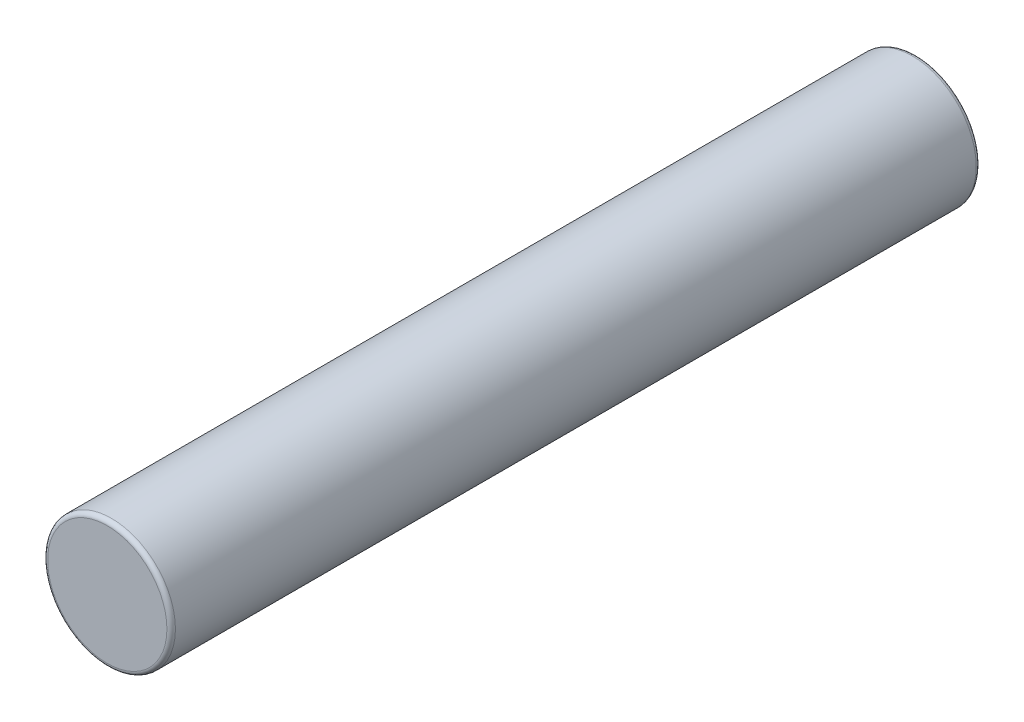
ISO-10303-21;
HEADER;
FILE_DESCRIPTION(('STEP AP214'),'2;1');
FILE_NAME('part.step','',(''),(''),'','','');
FILE_SCHEMA(('AUTOMOTIVE_DESIGN { 1 0 10303 214 1 1 1 1 }'));
ENDSEC;
DATA;
#1=APPLICATION_CONTEXT('core data for automotive mechanical design processes');
#2=APPLICATION_PROTOCOL_DEFINITION('international standard','automotive_design',2000,#1);
#3=PRODUCT_CONTEXT('',#1,'mechanical');
#4=PRODUCT('Part','Part','',(#3));
#5=PRODUCT_RELATED_PRODUCT_CATEGORY('part','',(#4));
#6=PRODUCT_DEFINITION_FORMATION('','',#4);
#7=PRODUCT_DEFINITION_CONTEXT('part definition',#1,'design');
#8=PRODUCT_DEFINITION('design','',#6,#7);
#9=PRODUCT_DEFINITION_SHAPE('','',#8);
#10=(LENGTH_UNIT() NAMED_UNIT(*) SI_UNIT(.MILLI.,.METRE.));
#11=(NAMED_UNIT(*) PLANE_ANGLE_UNIT() SI_UNIT($,.RADIAN.));
#12=(NAMED_UNIT(*) SI_UNIT($,.STERADIAN.) SOLID_ANGLE_UNIT());
#13=UNCERTAINTY_MEASURE_WITH_UNIT(LENGTH_MEASURE(1.E-05),#10,'distance_accuracy_value','');
#14=(GEOMETRIC_REPRESENTATION_CONTEXT(3) GLOBAL_UNCERTAINTY_ASSIGNED_CONTEXT((#13)) GLOBAL_UNIT_ASSIGNED_CONTEXT((#10,
#11,#12)) REPRESENTATION_CONTEXT('',''));
#15=CARTESIAN_POINT('',(0.,0.,0.));
#16=DIRECTION('',(0.,0.,1.));
#17=DIRECTION('',(1.,0.,0.));
#18=AXIS2_PLACEMENT_3D('',#15,#16,#17);
#19=CARTESIAN_POINT('',(0.,0.,-4.75));
#20=DIRECTION('',(0.,0.,1.));
#21=DIRECTION('',(1.,0.,0.));
#22=AXIS2_PLACEMENT_3D('',#19,#20,#21);
#23=CYLINDRICAL_SURFACE('',#22,0.75);
#24=CARTESIAN_POINT('',(0.,0.,-4.7));
#25=DIRECTION('',(0.,0.,1.));
#26=DIRECTION('',(1.,0.,0.));
#27=AXIS2_PLACEMENT_3D('',#24,#25,#26);
#28=CIRCLE('',#27,0.75);
#29=CARTESIAN_POINT('',(0.75,0.,-4.7));
#30=VERTEX_POINT('',#29);
#31=EDGE_CURVE('E41',#30,#30,#28,.T.);
#32=ORIENTED_EDGE('',*,*,#31,.T.);
#33=EDGE_LOOP('',(#32));
#34=FACE_BOUND('',#33,.T.);
#35=CARTESIAN_POINT('',(0.,0.,4.7));
#36=DIRECTION('',(0.,0.,1.));
#37=DIRECTION('',(1.,0.,0.));
#38=AXIS2_PLACEMENT_3D('',#35,#36,#37);
#39=CIRCLE('',#38,0.75);
#40=CARTESIAN_POINT('',(0.75,0.,4.7));
#41=VERTEX_POINT('',#40);
#42=EDGE_CURVE('E45',#41,#41,#39,.F.);
#43=ORIENTED_EDGE('',*,*,#42,.T.);
#44=EDGE_LOOP('',(#43));
#45=FACE_BOUND('',#44,.T.);
#46=ADVANCED_FACE('F30',(#34,#45),#23,.T.);
#47=CARTESIAN_POINT('',(0.,0.,-4.75));
#48=DIRECTION('',(0.,0.,1.));
#49=DIRECTION('',(1.,0.,0.));
#50=AXIS2_PLACEMENT_3D('',#47,#48,#49);
#51=PLANE('',#50);
#52=CARTESIAN_POINT('',(0.,0.,-4.75));
#53=DIRECTION('',(0.,0.,1.));
#54=DIRECTION('',(1.,0.,0.));
#55=AXIS2_PLACEMENT_3D('',#52,#53,#54);
#56=CIRCLE('',#55,0.7);
#57=CARTESIAN_POINT('',(0.7,0.,-4.75));
#58=VERTEX_POINT('',#57);
#59=EDGE_CURVE('E37',#58,#58,#56,.F.);
#60=ORIENTED_EDGE('',*,*,#59,.T.);
#61=EDGE_LOOP('',(#60));
#62=FACE_BOUND('',#61,.T.);
#63=ADVANCED_FACE('F61',(#62),#51,.F.);
#64=CARTESIAN_POINT('',(0.,0.,4.75));
#65=DIRECTION('',(0.,0.,1.));
#66=DIRECTION('',(1.,0.,0.));
#67=AXIS2_PLACEMENT_3D('',#64,#65,#66);
#68=PLANE('',#67);
#69=CARTESIAN_POINT('',(0.,0.,4.75));
#70=DIRECTION('',(0.,0.,1.));
#71=DIRECTION('',(1.,0.,0.));
#72=AXIS2_PLACEMENT_3D('',#69,#70,#71);
#73=CIRCLE('',#72,0.7);
#74=CARTESIAN_POINT('',(0.7,0.,4.75));
#75=VERTEX_POINT('',#74);
#76=EDGE_CURVE('E10',#75,#75,#73,.T.);
#77=ORIENTED_EDGE('',*,*,#76,.T.);
#78=EDGE_LOOP('',(#77));
#79=FACE_BOUND('',#78,.T.);
#80=ADVANCED_FACE('F58',(#79),#68,.T.);
#81=CARTESIAN_POINT('',(0.,0.,-4.7));
#82=DIRECTION('',(0.,0.,1.));
#83=DIRECTION('',(1.,0.,0.));
#84=AXIS2_PLACEMENT_3D('',#81,#82,#83);
#85=TOROIDAL_SURFACE('',#84,0.7,0.05);
#86=ORIENTED_EDGE('',*,*,#59,.F.);
#87=EDGE_LOOP('',(#86));
#88=FACE_BOUND('',#87,.T.);
#89=ORIENTED_EDGE('',*,*,#31,.F.);
#90=EDGE_LOOP('',(#89));
#91=FACE_BOUND('',#90,.T.);
#92=ADVANCED_FACE('F54',(#88,#91),#85,.T.);
#93=CARTESIAN_POINT('',(0.,0.,4.7));
#94=DIRECTION('',(0.,0.,1.));
#95=DIRECTION('',(1.,0.,0.));
#96=AXIS2_PLACEMENT_3D('',#93,#94,#95);
#97=TOROIDAL_SURFACE('',#96,0.7,0.05);
#98=ORIENTED_EDGE('',*,*,#42,.F.);
#99=EDGE_LOOP('',(#98));
#100=FACE_BOUND('',#99,.T.);
#101=ORIENTED_EDGE('',*,*,#76,.F.);
#102=EDGE_LOOP('',(#101));
#103=FACE_BOUND('',#102,.T.);
#104=ADVANCED_FACE('F32',(#100,#103),#97,.T.);
#105=CLOSED_SHELL('',(#46,#63,#80,#92,#104));
#106=MANIFOLD_SOLID_BREP('B2',#105);
#107=ADVANCED_BREP_SHAPE_REPRESENTATION('',(#18,#106),#14);
#108=SHAPE_DEFINITION_REPRESENTATION(#9,#107);
ENDSEC;
END-ISO-10303-21;
